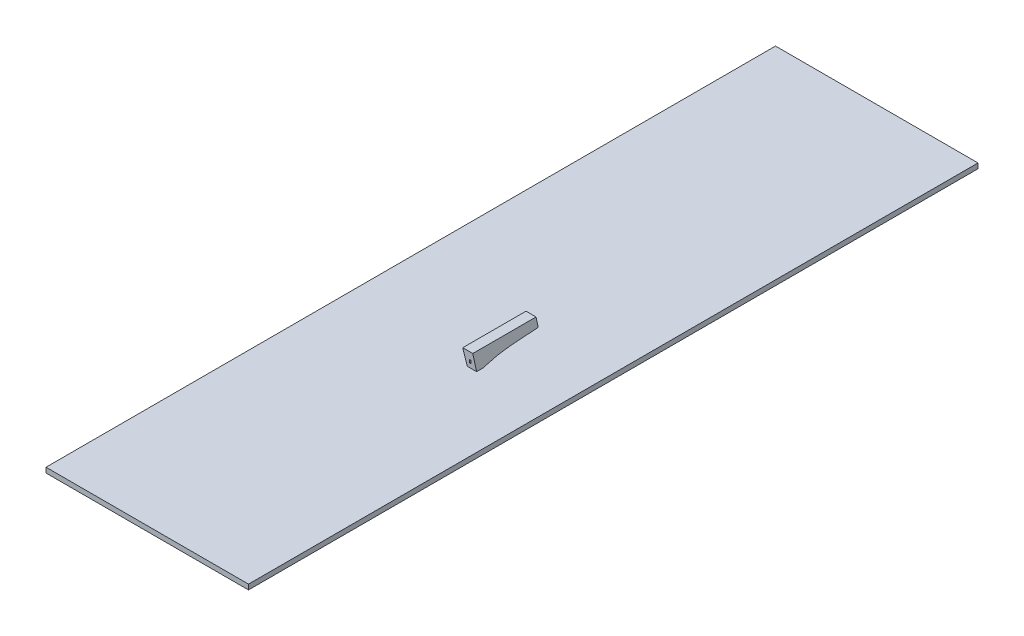
ISO-10303-21;
HEADER;
FILE_DESCRIPTION(('STEP AP214'),'2;1');
FILE_NAME('part.step','',(''),(''),'','','');
FILE_SCHEMA(('AUTOMOTIVE_DESIGN { 1 0 10303 214 1 1 1 1 }'));
ENDSEC;
DATA;
#1=APPLICATION_CONTEXT('core data for automotive mechanical design processes');
#2=APPLICATION_PROTOCOL_DEFINITION('international standard','automotive_design',2000,#1);
#3=PRODUCT_CONTEXT('',#1,'mechanical');
#4=PRODUCT('Part','Part','',(#3));
#5=PRODUCT_RELATED_PRODUCT_CATEGORY('part','',(#4));
#6=PRODUCT_DEFINITION_FORMATION('','',#4);
#7=PRODUCT_DEFINITION_CONTEXT('part definition',#1,'design');
#8=PRODUCT_DEFINITION('design','',#6,#7);
#9=PRODUCT_DEFINITION_SHAPE('','',#8);
#10=(LENGTH_UNIT() NAMED_UNIT(*) SI_UNIT(.MILLI.,.METRE.));
#11=(NAMED_UNIT(*) PLANE_ANGLE_UNIT() SI_UNIT($,.RADIAN.));
#12=(NAMED_UNIT(*) SI_UNIT($,.STERADIAN.) SOLID_ANGLE_UNIT());
#13=UNCERTAINTY_MEASURE_WITH_UNIT(LENGTH_MEASURE(1.E-05),#10,'distance_accuracy_value','');
#14=(GEOMETRIC_REPRESENTATION_CONTEXT(3) GLOBAL_UNCERTAINTY_ASSIGNED_CONTEXT((#13)) GLOBAL_UNIT_ASSIGNED_CONTEXT((#10,
#11,#12)) REPRESENTATION_CONTEXT('',''));
#15=CARTESIAN_POINT('',(0.,0.,0.));
#16=DIRECTION('',(0.,0.,1.));
#17=DIRECTION('',(1.,0.,0.));
#18=AXIS2_PLACEMENT_3D('',#15,#16,#17);
#19=CARTESIAN_POINT('',(0.,0.,-0.906787209581206));
#20=DIRECTION('',(0.,0.,1.));
#21=DIRECTION('',(1.,0.,0.));
#22=AXIS2_PLACEMENT_3D('',#19,#20,#21);
#23=PLANE('',#22);
#24=DIRECTION('',(0.2647824909299,-0.964308162620724,0.));
#25=VECTOR('',#24,1.);
#26=CARTESIAN_POINT('',(38.8064860248671,394.0012038353,-0.906787209581206));
#27=LINE('',#26,#25);
#28=CARTESIAN_POINT('',(54.3516519773393,337.387451299709,-0.906787209581206));
#29=VERTEX_POINT('',#28);
#30=CARTESIAN_POINT('',(58.641560608186,321.764084758008,-0.906787209581232));
#31=VERTEX_POINT('',#30);
#32=EDGE_CURVE('E497',#29,#31,#27,.T.);
#33=ORIENTED_EDGE('',*,*,#32,.T.);
#34=DIRECTION('',(1.,0.,0.));
#35=VECTOR('',#34,1.);
#36=CARTESIAN_POINT('',(51.0840248538438,321.764084758008,-0.906787209581232));
#37=LINE('',#36,#35);
#38=CARTESIAN_POINT('',(39.8206611898017,321.764084758008,-0.906787209581232));
#39=VERTEX_POINT('',#38);
#40=EDGE_CURVE('E14',#31,#39,#37,.F.);
#41=ORIENTED_EDGE('',*,*,#40,.T.);
#42=CARTESIAN_POINT('',(79.5934517566759,140.935265317445,-0.906787209581206));
#43=CARTESIAN_POINT('',(67.7143056578116,242.605545870488,-0.906787209581206));
#44=CARTESIAN_POINT('',(33.8252863264388,339.461806899819,-0.906787209581206));
#45=B_SPLINE_CURVE_WITH_KNOTS('',2,(#42,#43,#44),.UNSPECIFIED.,.F.,.F.,(3,3),(0.,1.),.UNSPECIFIED.);
#46=CARTESIAN_POINT('',(34.5483666432307,337.387451299709,-0.906787209581206));
#47=VERTEX_POINT('',#46);
#48=EDGE_CURVE('E509',#39,#47,#45,.T.);
#49=ORIENTED_EDGE('',*,*,#48,.T.);
#50=DIRECTION('',(-1.,0.,0.));
#51=VECTOR('',#50,1.);
#52=CARTESIAN_POINT('',(0.,337.387451299709,-0.906787209581206));
#53=LINE('',#52,#51);
#54=EDGE_CURVE('E514',#29,#47,#53,.T.);
#55=ORIENTED_EDGE('',*,*,#54,.F.);
#56=EDGE_LOOP('',(#33,#41,#49,#55));
#57=FACE_BOUND('',#56,.T.);
#58=DIRECTION('',(0.,1.,0.));
#59=VECTOR('',#58,1.);
#60=CARTESIAN_POINT('',(45.9013625124118,326.877081955028,-0.906787209581206));
#61=LINE('',#60,#59);
#62=CARTESIAN_POINT('',(45.9013625124118,326.877081955028,-0.906787209581206));
#63=VERTEX_POINT('',#62);
#64=CARTESIAN_POINT('',(45.9013625124118,331.877081955028,-0.906787209581206));
#65=VERTEX_POINT('',#64);
#66=EDGE_CURVE('E454',#63,#65,#61,.T.);
#67=ORIENTED_EDGE('',*,*,#66,.F.);
#68=DIRECTION('',(-1.,0.,0.));
#69=VECTOR('',#68,1.);
#70=CARTESIAN_POINT('',(47.9013625124118,326.877081955028,-0.906787209581206));
#71=LINE('',#70,#69);
#72=CARTESIAN_POINT('',(47.9013625124118,326.877081955028,-0.906787209581206));
#73=VERTEX_POINT('',#72);
#74=EDGE_CURVE('E451',#73,#63,#71,.T.);
#75=ORIENTED_EDGE('',*,*,#74,.F.);
#76=DIRECTION('',(0.,-1.,0.));
#77=VECTOR('',#76,1.);
#78=CARTESIAN_POINT('',(47.9013625124118,326.877081955028,-0.906787209581206));
#79=LINE('',#78,#77);
#80=CARTESIAN_POINT('',(47.9013625124118,331.877081955028,-0.906787209581206));
#81=VERTEX_POINT('',#80);
#82=EDGE_CURVE('E364',#81,#73,#79,.T.);
#83=ORIENTED_EDGE('',*,*,#82,.F.);
#84=DIRECTION('',(1.,0.,0.));
#85=VECTOR('',#84,1.);
#86=CARTESIAN_POINT('',(47.9013625124118,331.877081955028,-0.906787209581206));
#87=LINE('',#86,#85);
#88=EDGE_CURVE('E359',#65,#81,#87,.T.);
#89=ORIENTED_EDGE('',*,*,#88,.F.);
#90=EDGE_LOOP('',(#67,#75,#83,#89));
#91=FACE_BOUND('',#90,.T.);
#92=ADVANCED_FACE('F341',(#57,#91),#23,.F.);
#93=CARTESIAN_POINT('',(79.5934517566759,140.935265317445,459.688927372495));
#94=CARTESIAN_POINT('',(67.7143056578116,242.605545870488,459.688927372495));
#95=CARTESIAN_POINT('',(33.8252863264388,339.461806899819,459.688927372495));
#96=B_SPLINE_CURVE_WITH_KNOTS('',2,(#93,#94,#95),.UNSPECIFIED.,.F.,.F.,(3,3),(0.,1.),.UNSPECIFIED.);
#97=DIRECTION('',(0.,0.,-1.));
#98=VECTOR('',#97,1.);
#99=SURFACE_OF_LINEAR_EXTRUSION('',#96,#98);
#100=ORIENTED_EDGE('',*,*,#48,.F.);
#101=CARTESIAN_POINT('',(79.5934517566759,140.935265317445,391.136402899549));
#102=CARTESIAN_POINT('',(79.3687636637498,142.858316453914,389.058424904759));
#103=CARTESIAN_POINT('',(79.1392182173972,144.771086035841,386.971456801504));
#104=CARTESIAN_POINT('',(78.6706941483576,148.576580548362,382.778754123729));
#105=CARTESIAN_POINT('',(78.4317115785407,150.46929666258,380.673011988149));
#106=CARTESIAN_POINT('',(77.9447031754796,154.234211981581,376.443017842211));
#107=CARTESIAN_POINT('',(77.6966743145013,156.106404039311,374.318759819137));
#108=CARTESIAN_POINT('',(77.1919729110904,159.82981437306,370.052003197144));
#109=CARTESIAN_POINT('',(76.9352981935649,161.681027212279,367.909500111035));
#110=CARTESIAN_POINT('',(76.4137119289455,165.362035729348,363.606533479653));
#111=CARTESIAN_POINT('',(76.1487989922105,167.191827721442,361.446066949791));
#112=CARTESIAN_POINT('',(75.611150182316,170.829565172322,357.107465303158));
#113=CARTESIAN_POINT('',(75.3384136380759,172.637508738012,354.929328682273));
#114=CARTESIAN_POINT('',(74.7825838359121,176.250333696679,350.532323341911));
#115=CARTESIAN_POINT('',(74.499411042229,178.054975844669,348.313268092065));
#116=CARTESIAN_POINT('',(73.9259406297601,181.641120417636,343.857727305795));
#117=CARTESIAN_POINT('',(73.635643544893,183.422624561445,341.62124308408));
#118=CARTESIAN_POINT('',(73.0483658059418,186.96211123388,337.131159839954));
#119=CARTESIAN_POINT('',(72.7513861636136,188.720097259792,334.877563442147));
#120=CARTESIAN_POINT('',(72.1511885718739,192.212179894735,330.353583779646));
#121=CARTESIAN_POINT('',(71.8479720472944,193.946281812281,328.083204423347));
#122=CARTESIAN_POINT('',(71.2357484385393,197.390246372087,323.525993628031));
#123=CARTESIAN_POINT('',(70.9267431282756,199.100116166777,321.239167357176));
#124=CARTESIAN_POINT('',(70.303394231065,202.495271118772,316.649425312154));
#125=CARTESIAN_POINT('',(69.989052702724,204.18056531048,314.34651593565));
#126=CARTESIAN_POINT('',(69.0335808605556,209.22611062359,307.376860789141));
#127=CARTESIAN_POINT('',(68.3847399206868,212.549439665433,302.68435652347));
#128=CARTESIAN_POINT('',(67.0701854973035,219.095768358947,293.233369364994));
#129=CARTESIAN_POINT('',(66.404474671083,222.31878363571,288.474896916127));
#130=CARTESIAN_POINT('',(65.0592484047373,228.664771029444,278.890806517958));
#131=CARTESIAN_POINT('',(64.3797274891773,231.787702148571,274.065162185009));
#132=CARTESIAN_POINT('',(63.0099032766274,237.933677624573,264.345567383805));
#133=CARTESIAN_POINT('',(62.3195901962393,240.956622557449,259.451555424208));
#134=CARTESIAN_POINT('',(60.9311537864223,246.902696215732,249.59402280875));
#135=CARTESIAN_POINT('',(60.2330201292298,249.825665260063,244.63040731805));
#136=CARTESIAN_POINT('',(58.8318541371306,255.571818036939,234.63232496169));
#137=CARTESIAN_POINT('',(58.1288146069011,258.3947800764,229.597731531008));
#138=CARTESIAN_POINT('',(57.1935213979447,262.078580898934,222.861633852702));
#139=CARTESIAN_POINT('',(56.9613207265983,262.987258538716,221.18615655955));
#140=CARTESIAN_POINT('',(56.497018148693,264.7928870135,217.828873855044));
#141=CARTESIAN_POINT('',(56.2649162420974,265.68983785287,216.147068446046));
#142=CARTESIAN_POINT('',(55.800928193183,267.471976095472,212.777211285217));
#143=CARTESIAN_POINT('',(55.5690420506503,268.357163510387,211.089159539592));
#144=CARTESIAN_POINT('',(55.1055150104447,270.116067691075,207.706271742908));
#145=CARTESIAN_POINT('',(54.8738742313432,270.989780205917,206.011433465154));
#146=CARTESIAN_POINT('',(54.4110369855361,272.725374072101,202.615647068307));
#147=CARTESIAN_POINT('',(54.179840519342,273.587255409829,200.914698942185));
#148=CARTESIAN_POINT('',(53.7179943512896,275.299197010219,197.506781668418));
#149=CARTESIAN_POINT('',(53.4873446517118,276.14925722365,195.799812495733));
#150=CARTESIAN_POINT('',(53.0269738339519,277.836536495195,192.381629132772));
#151=CARTESIAN_POINT('',(52.7972520043579,278.673767869785,190.67042112013));
#152=CARTESIAN_POINT('',(52.3389524274677,280.335025036273,187.241457973822));
#153=CARTESIAN_POINT('',(52.1103746759706,281.159050876684,185.523702864236));
#154=CARTESIAN_POINT('',(51.6548089568672,282.792719975596,182.08115155259));
#155=CARTESIAN_POINT('',(51.4278209902987,283.602363224708,180.356355345934));
#156=CARTESIAN_POINT('',(50.9764347080471,285.204166233441,176.903262793913));
#157=CARTESIAN_POINT('',(50.7520315978677,285.996362270641,175.174983914252));
#158=CARTESIAN_POINT('',(50.3057700035484,287.563957184985,171.710489726359));
#159=CARTESIAN_POINT('',(50.08391152346,288.339356035386,169.974274405498));
#160=CARTESIAN_POINT('',(49.6432519360557,289.872067534303,166.493483392676));
#161=CARTESIAN_POINT('',(49.4244508342734,290.629380150087,164.748907685592));
#162=CARTESIAN_POINT('',(48.9911261503781,292.122232551045,161.256522813757));
#163=CARTESIAN_POINT('',(48.7765912520355,292.857833483018,159.508741209265));
#164=CARTESIAN_POINT('',(48.3516444346216,294.30838915643,156.004124540337));
#165=CARTESIAN_POINT('',(48.1412325188313,295.023343881441,154.247289468698));
#166=CARTESIAN_POINT('',(47.7251065291384,296.431212900646,150.724240653962));
#167=CARTESIAN_POINT('',(47.5193924759146,297.124127097828,148.958026869625));
#168=CARTESIAN_POINT('',(47.1139326989118,298.484219907492,145.421805991695));
#169=CARTESIAN_POINT('',(46.9141694950678,299.151476015422,143.651830733281));
#170=CARTESIAN_POINT('',(46.5205199756487,300.461188371476,140.102073425613));
#171=CARTESIAN_POINT('',(46.3266336532539,301.103644648379,138.322291387742));
#172=CARTESIAN_POINT('',(45.9453739079274,302.362242621571,134.752752367418));
#173=CARTESIAN_POINT('',(45.7580004518728,302.978384451692,132.962995435748));
#174=CARTESIAN_POINT('',(45.412362874862,304.110906172488,129.587659618129));
#175=CARTESIAN_POINT('',(45.2532940471008,304.630414655301,128.00321278615));
#176=CARTESIAN_POINT('',(44.9411751369235,305.646729573562,124.82646647527));
#177=CARTESIAN_POINT('',(44.7881250235742,306.143536125687,123.234167036774));
#178=CARTESIAN_POINT('',(44.4885125739872,307.113336654501,120.041728414348));
#179=CARTESIAN_POINT('',(44.3419502057827,307.58633074852,118.441589269089));
#180=CARTESIAN_POINT('',(44.0557904643589,308.507375963105,115.233533855774));
#181=CARTESIAN_POINT('',(43.9161930436221,308.955427253841,113.625617640857));
#182=CARTESIAN_POINT('',(43.644444429816,309.825447090637,110.402098735397));
#183=CARTESIAN_POINT('',(43.5122932892914,310.247415452644,108.786495990701));
#184=CARTESIAN_POINT('',(43.2559229860042,311.06411545842,105.547753800314));
#185=CARTESIAN_POINT('',(43.1317039786648,311.458846568511,103.924614207613));
#186=CARTESIAN_POINT('',(42.8915869900027,312.220221497844,100.669676049396));
#187=CARTESIAN_POINT('',(42.7756961754288,312.586841143781,99.0378712936177));
#188=CARTESIAN_POINT('',(42.5528411696622,313.290447151525,95.7672901602894));
#189=CARTESIAN_POINT('',(42.4458768988971,313.627433777486,94.128513845022));
#190=CARTESIAN_POINT('',(42.2413582918541,314.270607486355,90.8443839934129));
#191=CARTESIAN_POINT('',(42.1438036124382,314.576795692402,89.1990306991933));
#192=CARTESIAN_POINT('',(42.0047594536942,315.012505646415,86.7241653987626));
#193=CARTESIAN_POINT('',(41.959570013736,315.153988484577,85.8969502781906));
#194=CARTESIAN_POINT('',(41.8717291248578,315.428794554503,84.2410289713605));
#195=CARTESIAN_POINT('',(41.829077671705,315.562117799876,83.4123227875915));
#196=CARTESIAN_POINT('',(41.7463853686939,315.820416118048,81.7534676097719));
#197=CARTESIAN_POINT('',(41.7063445592124,315.945391061731,80.9233185936097));
#198=CARTESIAN_POINT('',(41.6288600410489,316.187071243191,79.2616969834744));
#199=CARTESIAN_POINT('',(41.5914163350786,316.303776472334,78.4302243881202));
#200=CARTESIAN_POINT('',(41.518969595952,316.529437433033,76.7661252873505));
#201=CARTESIAN_POINT('',(41.4839665578271,316.638393180366,75.9334987842877));
#202=CARTESIAN_POINT('',(41.4162677295902,316.848998741198,74.267231422881));
#203=CARTESIAN_POINT('',(41.3835719402733,316.95064855218,73.4335905641876));
#204=CARTESIAN_POINT('',(41.2884731287368,317.24614563523,70.924497476887));
#205=CARTESIAN_POINT('',(41.2293531562595,317.429623670987,69.2476923090992));
#206=CARTESIAN_POINT('',(41.1186864414602,317.772762232303,65.8914184196841));
#207=CARTESIAN_POINT('',(41.067139744911,317.932422613908,64.21194968202));
#208=CARTESIAN_POINT('',(40.970439680571,318.231701474804,60.8510535896531));
#209=CARTESIAN_POINT('',(40.9252863265314,318.371319910988,59.1696262307453));
#210=CARTESIAN_POINT('',(40.8400619961568,318.63465615311,55.8005760519653));
#211=CARTESIAN_POINT('',(40.8000059094358,318.758327389135,54.1129492566728));
#212=CARTESIAN_POINT('',(40.7239214791555,318.99308596241,50.7367655370398));
#213=CARTESIAN_POINT('',(40.6878930739243,319.104173492343,49.0482086273391));
#214=CARTESIAN_POINT('',(40.6359630456762,319.264197698118,46.5149135969881));
#215=CARTESIAN_POINT('',(40.6190050756038,319.316438094726,45.6704022676302));
#216=CARTESIAN_POINT('',(40.5856408996054,319.419189335268,43.9812632290033));
#217=CARTESIAN_POINT('',(40.5692346937492,319.469700178983,43.1366355197197));
#218=CARTESIAN_POINT('',(40.536447367354,319.570616212936,41.4276233964024));
#219=CARTESIAN_POINT('',(40.5200757322497,319.620991537739,40.5632370466643));
#220=CARTESIAN_POINT('',(40.4875799199071,319.720952362135,38.8344141612651));
#221=CARTESIAN_POINT('',(40.4714557426548,319.770537861775,37.9699776256068));
#222=CARTESIAN_POINT('',(40.439434912289,319.868981566441,36.2410633360226));
#223=CARTESIAN_POINT('',(40.4235382580167,319.917839775172,35.3765855823293));
#224=CARTESIAN_POINT('',(40.3919734255628,320.014827200075,33.6475851008558));
#225=CARTESIAN_POINT('',(40.3763052473648,320.062956416298,32.7830623730788));
#226=CARTESIAN_POINT('',(40.3296368680389,320.206272523646,30.1894312432049));
#227=CARTESIAN_POINT('',(40.2989727772147,320.30038801168,28.4602574658485));
#228=CARTESIAN_POINT('',(40.2385260916251,320.485816445595,25.0023921333561));
#229=CARTESIAN_POINT('',(40.2087431719832,320.577130424827,23.2737006392541));
#230=CARTESIAN_POINT('',(40.1500193978231,320.757085335096,19.8161631632826));
#231=CARTESIAN_POINT('',(40.1210785438326,320.845726264459,18.087317181317));
#232=CARTESIAN_POINT('',(40.0640114132314,321.02042723996,14.6294811641508));
#233=CARTESIAN_POINT('',(40.0358851367489,321.106487285693,12.9004911289275));
#234=CARTESIAN_POINT('',(39.9804851244808,321.27591789444,9.44648148040414));
#235=CARTESIAN_POINT('',(39.9532095231717,321.359294357605,7.7214621863334));
#236=CARTESIAN_POINT('',(39.8994133376696,321.523663333882,4.27129834118603));
#237=CARTESIAN_POINT('',(39.8728927534583,321.604655847052,2.5461537901124));
#238=CARTESIAN_POINT('',(39.8205783754032,321.764349598502,-0.904252327572544));
#239=CARTESIAN_POINT('',(39.7947845815566,321.843050836791,-2.62951389418343));
#240=CARTESIAN_POINT('',(39.7440069895873,321.997914335382,-6.07257259590344));
#241=CARTESIAN_POINT('',(39.7190201328799,322.074086224439,-7.79036925303446));
#242=CARTESIAN_POINT('',(39.6697102727143,322.224342880412,-11.2260632369104));
#243=CARTESIAN_POINT('',(39.6453872692134,322.298427647463,-12.9439605636488));
#244=CARTESIAN_POINT('',(39.5973764748641,322.44460230926,-16.3798487659021));
#245=CARTESIAN_POINT('',(39.5736886839783,322.516692204125,-18.0978396414114));
#246=CARTESIAN_POINT('',(39.4806022731079,322.79987314704,-24.9368108408412));
#247=CARTESIAN_POINT('',(39.4135952610566,323.003463425198,-30.0581349643992));
#248=CARTESIAN_POINT('',(39.2847468674091,323.394525627863,-40.2577563729538));
#249=CARTESIAN_POINT('',(39.222866335664,323.582120111609,-45.3360484541877));
#250=CARTESIAN_POINT('',(39.162875884002,323.763812935846,-50.4145633031885));
#251=B_SPLINE_CURVE_WITH_KNOTS('',3,(#101,#102,#103,#104,#105,#106,#107,#108,#109,#110,#111,
#112,#113,#114,#115,#116,#117,#118,#119,#120,#121,#122,#123,#124,#125,#126,#127,#128,#129,#130,
#131,#132,#133,#134,#135,#136,#137,#138,#139,#140,#141,#142,#143,#144,#145,#146,#147,#148,#149,
#150,#151,#152,#153,#154,#155,#156,#157,#158,#159,#160,#161,#162,#163,#164,#165,#166,#167,#168,
#169,#170,#171,#172,#173,#174,#175,#176,#177,#178,#179,#180,#181,#182,#183,#184,#185,#186,#187,
#188,#189,#190,#191,#192,#193,#194,#195,#196,#197,#198,#199,#200,#201,#202,#203,#204,#205,#206,
#207,#208,#209,#210,#211,#212,#213,#214,#215,#216,#217,#218,#219,#220,#221,#222,#223,#224,#225,
#226,#227,#228,#229,#230,#231,#232,#233,#234,#235,#236,#237,#238,#239,#240,#241,#242,#243,#244,
#245,#246,#247,#248,#249,#250),.UNSPECIFIED.,.F.,.F.,(4,2,2,2,2,2,2,2,2,2,2,2,2,2,2,2,2,2,2,2,2,
2,2,2,2,2,2,2,2,2,2,2,2,2,2,2,2,2,2,2,2,2,2,2,2,2,2,2,2,2,2,2,2,2,2,2,2,2,2,2,2,2,2,2,2,2,2,2,2,
2,2,2,2,2,4),(0.,8.52049310582925,17.0445885068398,25.571563529311,34.1006999982727,
42.6312830692685,51.1626000635804,59.7850975333847,68.4069507652903,77.0275072952003,
85.6461158414953,94.2621251628804,102.87488291321,120.233391736256,137.589183089328,
154.951995373444,172.331583282363,189.737743773242,207.180341250756,212.940653116987,
218.700962837602,224.461266836584,230.223647768719,235.986035330797,241.74844688381,
247.504927353859,253.26138667179,259.017849747183,264.760926907832,270.504013211035,
276.247109907106,281.972089895268,287.697074438878,293.422084177621,299.128170578043,
304.834250356832,310.540301111698,315.56516462438,320.590002308422,325.614815231164,
330.639593868169,335.664407958111,340.689320474734,345.718506598372,350.747647886409,
355.776605708204,358.297897796688,360.819185680174,363.340512549271,365.861842050932,
368.383166419455,370.904491656798,375.967794947679,381.031128839784,386.094473622234,
391.172285043374,396.250018702513,398.788903815364,401.327789249377,403.925812003328,
406.523834609713,409.121843977882,411.719853159037,416.915864222169,422.109935086548,
427.304009205013,432.498084140841,437.679827561599,442.861570857705,448.043314134694,
453.202311299509,458.361308132942,463.520304662313,478.897699630201,494.144067563522),.UNSPECIFIED.);
#252=CARTESIAN_POINT('',(44.8715710734919,305.872294377729,124.093212790419));
#253=VERTEX_POINT('',#252);
#254=EDGE_CURVE('E543',#253,#39,#251,.T.);
#255=ORIENTED_EDGE('',*,*,#254,.F.);
#256=CARTESIAN_POINT('',(79.5934517566759,140.935265317445,124.093212790419));
#257=CARTESIAN_POINT('',(67.7143056578116,242.605545870488,124.093212790419));
#258=CARTESIAN_POINT('',(33.8252863264388,339.461806899819,124.093212790419));
#259=B_SPLINE_CURVE_WITH_KNOTS('',2,(#256,#257,#258),.UNSPECIFIED.,.F.,.F.,(3,3),(0.,1.),.UNSPECIFIED.);
#260=CARTESIAN_POINT('',(34.5483666432307,337.387451299709,124.093212790419));
#261=VERTEX_POINT('',#260);
#262=EDGE_CURVE('E524',#261,#253,#259,.F.);
#263=ORIENTED_EDGE('',*,*,#262,.F.);
#264=DIRECTION('',(0.,0.,-1.));
#265=VECTOR('',#264,1.);
#266=CARTESIAN_POINT('',(34.5483666432307,337.387451299709,-75.3342967017252));
#267=LINE('',#266,#265);
#268=EDGE_CURVE('E540',#47,#261,#267,.F.);
#269=ORIENTED_EDGE('',*,*,#268,.F.);
#270=EDGE_LOOP('',(#100,#255,#263,#269));
#271=FACE_BOUND('',#270,.T.);
#272=ADVANCED_FACE('F555',(#271),#99,.T.);
#273=CARTESIAN_POINT('',(38.8064860248671,394.0012038353,482.120102696812));
#274=DIRECTION('',(0.964308162620724,0.2647824909299,0.));
#275=DIRECTION('',(-0.2647824909299,0.964308162620724,0.));
#276=AXIS2_PLACEMENT_3D('',#273,#274,#275);
#277=PLANE('',#276);
#278=ORIENTED_EDGE('',*,*,#32,.F.);
#279=DIRECTION('',(0.,0.,-1.));
#280=VECTOR('',#279,1.);
#281=CARTESIAN_POINT('',(54.3516519773393,337.387451299709,482.120102696812));
#282=LINE('',#281,#280);
#283=CARTESIAN_POINT('',(54.3516519773393,337.387451299709,124.093212790419));
#284=VERTEX_POINT('',#283);
#285=EDGE_CURVE('E536',#284,#29,#282,.T.);
#286=ORIENTED_EDGE('',*,*,#285,.F.);
#287=DIRECTION('',(-0.2647824909299,0.964308162620724,0.));
#288=VECTOR('',#287,1.);
#289=CARTESIAN_POINT('',(38.8064860248671,394.0012038353,124.093212790419));
#290=LINE('',#289,#288);
#291=CARTESIAN_POINT('',(63.0051738236856,305.872294377729,124.093212790419));
#292=VERTEX_POINT('',#291);
#293=EDGE_CURVE('E521',#292,#284,#290,.T.);
#294=ORIENTED_EDGE('',*,*,#293,.F.);
#295=CARTESIAN_POINT('',(58.0924695306286,323.763812935846,-50.4145633031885));
#296=CARTESIAN_POINT('',(58.1103275309392,323.698776099735,-48.596729738279));
#297=CARTESIAN_POINT('',(58.1283930428494,323.632983529631,-46.7789251340995));
#298=CARTESIAN_POINT('',(58.1649694034,323.499776522952,-43.1433783443442));
#299=CARTESIAN_POINT('',(58.1834802524085,323.432362085036,-41.3256361588211));
#300=CARTESIAN_POINT('',(58.2209775764716,323.29580103244,-37.6902212039755));
#301=CARTESIAN_POINT('',(58.2399640516583,323.226654417278,-35.8725484346726));
#302=CARTESIAN_POINT('',(58.2786031719773,323.085935070658,-32.2221346028775));
#303=CARTESIAN_POINT('',(58.2982600495728,323.014346925043,-30.3893941790576));
#304=CARTESIAN_POINT('',(58.3381190902829,322.869184765053,-26.7239983017079));
#305=CARTESIAN_POINT('',(58.3583212532674,322.795610751151,-24.8913428481578));
#306=CARTESIAN_POINT('',(58.3993017664988,322.646364313901,-21.2261241093133));
#307=CARTESIAN_POINT('',(58.4200801166438,322.570691890924,-19.3935608240026));
#308=CARTESIAN_POINT('',(58.4623728293333,322.416666570282,-15.7173219975736));
#309=CARTESIAN_POINT('',(58.4838909171994,322.338300105413,-13.8736470674289));
#310=CARTESIAN_POINT('',(58.5275729097689,322.17921518312,-10.1864059530417));
#311=CARTESIAN_POINT('',(58.5497368145874,322.098496725276,-8.34283976881855));
#312=CARTESIAN_POINT('',(58.594741702751,321.934593965461,-4.65582439171699));
#313=CARTESIAN_POINT('',(58.6175826864025,321.851409662375,-2.81237519889186));
#314=CARTESIAN_POINT('',(58.6640646588103,321.682127527253,0.881689150167304));
#315=CARTESIAN_POINT('',(58.687708455122,321.596019470415,2.73230380275307));
#316=CARTESIAN_POINT('',(58.7357413392612,321.421089088549,6.43339466275907));
#317=CARTESIAN_POINT('',(58.7601304268699,321.332266764319,8.28387087021979));
#318=CARTESIAN_POINT('',(58.809685216654,321.151793772627,11.9846730173851));
#319=CARTESIAN_POINT('',(58.8348509179913,321.060143108218,13.8349989572497));
#320=CARTESIAN_POINT('',(58.8860370248498,320.873729042533,17.5388805026588));
#321=CARTESIAN_POINT('',(58.9120589113898,320.778960247552,19.3924358164134));
#322=CARTESIAN_POINT('',(58.964944822574,320.586355684979,23.0993762141358));
#323=CARTESIAN_POINT('',(58.9918088477191,320.488519915563,24.9527612980018));
#324=CARTESIAN_POINT('',(59.0464102319822,320.289667792258,28.6593522111146));
#325=CARTESIAN_POINT('',(59.0741475929995,320.188651431453,30.5125580399628));
#326=CARTESIAN_POINT('',(59.1164282170848,320.034670136153,33.2919781636149));
#327=CARTESIAN_POINT('',(59.1306322958778,319.982940472781,34.2182662078862));
#328=CARTESIAN_POINT('',(59.1592702272593,319.87864433562,36.0707918009839));
#329=CARTESIAN_POINT('',(59.1737040798776,319.826077861723,36.9970293498038));
#330=CARTESIAN_POINT('',(59.1955302518753,319.746589388969,38.3863465550612));
#331=CARTESIAN_POINT('',(59.2028348765556,319.719986764379,38.8494458855016));
#332=CARTESIAN_POINT('',(59.2175027754403,319.666567920205,39.775631294913));
#333=CARTESIAN_POINT('',(59.2248660496443,319.639751700622,40.2387173738842));
#334=CARTESIAN_POINT('',(59.2470753086739,319.558868067823,41.6279484696579));
#335=CARTESIAN_POINT('',(59.2620407299888,319.504365680296,42.5540663499135));
#336=CARTESIAN_POINT('',(59.2924607550998,319.393579357459,44.4061952047087));
#337=CARTESIAN_POINT('',(59.3079153626103,319.337295408622,45.3322061783828));
#338=CARTESIAN_POINT('',(59.3394839834182,319.22232602896,47.1840674457561));
#339=CARTESIAN_POINT('',(59.3555979966217,319.163640598476,48.1099177394781));
#340=CARTESIAN_POINT('',(59.4044770952174,318.98562839838,50.8475086254013));
#341=CARTESIAN_POINT('',(59.4384168221305,318.862023715969,52.6589553197908));
#342=CARTESIAN_POINT('',(59.510756897821,318.598569266137,56.2805779017311));
#343=CARTESIAN_POINT('',(59.5491572126038,318.458719622521,58.0907537988611));
#344=CARTESIAN_POINT('',(59.6317070252416,318.158082454747,61.7093072396926));
#345=CARTESIAN_POINT('',(59.6758566844122,317.997294343095,63.5176847314992));
#346=CARTESIAN_POINT('',(59.7710001597116,317.650792467049,67.124412660302));
#347=CARTESIAN_POINT('',(59.821965216286,317.46518344173,68.9227738384135));
#348=CARTESIAN_POINT('',(59.9321552876181,317.06388354893,72.5159054189664));
#349=CARTESIAN_POINT('',(59.9913801987027,316.848193059016,74.3106758661897));
#350=CARTESIAN_POINT('',(60.0873594552178,316.498647361433,76.9991400429011));
#351=CARTESIAN_POINT('',(60.1205421829232,316.377799585314,77.8946631604459));
#352=CARTESIAN_POINT('',(60.1894519366142,316.126837983831,79.6843146688381));
#353=CARTESIAN_POINT('',(60.2251789567387,315.996724179813,80.5784430628937));
#354=CARTESIAN_POINT('',(60.2991497155366,315.727330964825,82.3612689894322));
#355=CARTESIAN_POINT('',(60.33738195145,315.588093445618,83.2499733259229));
#356=CARTESIAN_POINT('',(60.4164380116852,315.300180132613,85.0257338174542));
#357=CARTESIAN_POINT('',(60.4572618420167,315.151504316928,85.9127899686679));
#358=CARTESIAN_POINT('',(60.5835596120438,314.691541990377,88.571464819865));
#359=CARTESIAN_POINT('',(60.6728566611969,314.366332143254,90.340513710488));
#360=CARTESIAN_POINT('',(60.8612523355976,313.680216207155,93.8711511699027));
#361=CARTESIAN_POINT('',(60.960351099798,313.319309612129,95.6327396325633));
#362=CARTESIAN_POINT('',(61.1677526091826,312.563976554656,99.1445383962014));
#363=CARTESIAN_POINT('',(61.2760369267274,312.169617203607,100.894764234385));
#364=CARTESIAN_POINT('',(61.5015795505212,311.348216240199,104.386910201218));
#365=CARTESIAN_POINT('',(61.6188376757629,310.921175287049,106.128830496642));
#366=CARTESIAN_POINT('',(61.8619308670524,310.035857123394,109.604060140812));
#367=CARTESIAN_POINT('',(61.987765878717,309.577580110947,111.337369544083));
#368=CARTESIAN_POINT('',(62.5073368189492,307.685360965464,118.251090939567));
#369=CARTESIAN_POINT('',(62.9338305505371,306.132118584396,123.396853793968));
#370=CARTESIAN_POINT('',(63.850135222645,302.795039642137,133.607368648497));
#371=CARTESIAN_POINT('',(64.339958889208,301.011156734122,138.672104135821));
#372=CARTESIAN_POINT('',(65.3843292218594,297.207677006147,148.831056013257));
#373=CARTESIAN_POINT('',(65.9400428466358,295.183830253405,153.923557141167));
#374=CARTESIAN_POINT('',(66.7123963440279,292.371005359477,160.667053262973));
#375=CARTESIAN_POINT('',(66.9084720538192,291.656919595046,162.352138522303));
#376=CARTESIAN_POINT('',(67.3054768657702,290.211072555012,165.714156201095));
#377=CARTESIAN_POINT('',(67.5064059548867,289.479311326909,167.391088642452));
#378=CARTESIAN_POINT('',(67.9127861366554,287.999320240525,170.737102130768));
#379=CARTESIAN_POINT('',(68.1182372192594,287.251090418838,172.406183195164));
#380=CARTESIAN_POINT('',(68.533861204292,285.737434436751,175.741008672689));
#381=CARTESIAN_POINT('',(68.7440445786847,284.971970138631,177.406734465441));
#382=CARTESIAN_POINT('',(69.1683260732099,283.426784477061,180.731053760155));
#383=CARTESIAN_POINT('',(69.3824241913056,282.647063121029,182.389647265827));
#384=CARTESIAN_POINT('',(69.8142303384837,281.074473517649,185.700120703644));
#385=CARTESIAN_POINT('',(70.0319383778653,280.281605232791,187.35200061662));
#386=CARTESIAN_POINT('',(70.471056813451,278.682385094385,190.652346936369));
#387=CARTESIAN_POINT('',(70.6924730259353,277.876012058595,192.300802298467));
#388=CARTESIAN_POINT('',(71.1383201794037,276.252286683624,195.591881009366));
#389=CARTESIAN_POINT('',(71.3627511135501,275.434934369346,197.234504371383));
#390=CARTESIAN_POINT('',(71.8145796951821,273.789425303233,200.513920719568));
#391=CARTESIAN_POINT('',(72.0419773418419,272.961268554406,202.150713707357));
#392=CARTESIAN_POINT('',(72.4999130685127,271.293517950378,205.419605755907));
#393=CARTESIAN_POINT('',(72.730453392923,270.453915921327,207.051700332066));
#394=CARTESIAN_POINT('',(73.1944927764068,268.763936483111,210.309876435113));
#395=CARTESIAN_POINT('',(73.4279918318746,267.91355908708,211.935957969326));
#396=CARTESIAN_POINT('',(73.897938930318,266.202064412952,215.182030769378));
#397=CARTESIAN_POINT('',(74.1343869722025,265.340947138829,216.802022037471));
#398=CARTESIAN_POINT('',(74.6101578671048,263.608242850564,220.035412083052));
#399=CARTESIAN_POINT('',(74.8494799445537,262.736658660957,221.648812488319));
#400=CARTESIAN_POINT('',(75.3310487812649,260.982838918294,224.869377861677));
#401=CARTESIAN_POINT('',(75.5732955427738,260.100603357056,226.476542824978));
#402=CARTESIAN_POINT('',(76.0607009689852,258.325527409433,229.684560571918));
#403=CARTESIAN_POINT('',(76.3058596345733,257.432687019823,231.285413353637));
#404=CARTESIAN_POINT('',(76.9260596556092,255.173988037719,235.30340096982));
#405=CARTESIAN_POINT('',(77.3029790291753,253.801289913673,237.716407122199));
#406=CARTESIAN_POINT('',(78.0634228045759,251.031838892733,242.527509732558));
#407=CARTESIAN_POINT('',(78.4469472051613,249.635086000388,244.925606193358));
#408=CARTESIAN_POINT('',(79.6060537911647,245.413749694104,252.089128034833));
#409=CARTESIAN_POINT('',(80.3914384132092,242.553466904352,256.832006678827));
#410=CARTESIAN_POINT('',(81.9869404580501,236.742827235865,266.249748500933));
#411=CARTESIAN_POINT('',(82.7970261836483,233.792585794773,270.924688347707));
#412=CARTESIAN_POINT('',(84.4417525072176,227.802676818825,280.207225186668));
#413=CARTESIAN_POINT('',(85.2763732446059,224.763081613985,284.814872361476));
#414=CARTESIAN_POINT('',(86.9699853777434,218.59513599733,293.963407906433));
#415=CARTESIAN_POINT('',(87.8289681261411,215.466817078201,298.50431911688));
#416=CARTESIAN_POINT('',(89.5711368699703,209.122033726261,307.520010454554));
#417=CARTESIAN_POINT('',(90.4543247733438,205.90556234494,311.994785325624));
#418=CARTESIAN_POINT('',(91.9235135361462,200.55494149601,319.28489324262));
#419=CARTESIAN_POINT('',(92.5025829998574,198.446035394931,322.120195568424));
#420=CARTESIAN_POINT('',(93.6705036860285,194.192599123472,327.763682204889));
#421=CARTESIAN_POINT('',(94.2593585701167,192.048055617853,330.571855712947));
#422=CARTESIAN_POINT('',(95.4466624802807,187.724027816537,336.160563772447));
#423=CARTESIAN_POINT('',(96.0451144553963,185.544532780767,338.941089385791));
#424=CARTESIAN_POINT('',(97.2514201410801,181.15130264219,344.474022741156));
#425=CARTESIAN_POINT('',(97.859276084408,178.937559407923,347.22642353978));
#426=CARTESIAN_POINT('',(99.0841886302409,174.476565169615,352.702647770767));
#427=CARTESIAN_POINT('',(99.7012467429562,172.229308665557,355.426466384587));
#428=CARTESIAN_POINT('',(100.944355178448,167.702047035991,360.84509208247));
#429=CARTESIAN_POINT('',(101.570406282041,165.42203906684,363.539896611413));
#430=CARTESIAN_POINT('',(102.823220401077,160.859430425346,368.865800724099));
#431=CARTESIAN_POINT('',(103.449871965489,158.577235645172,371.49727428761));
#432=CARTESIAN_POINT('',(104.711503082529,153.982516484908,376.73113114418));
#433=CARTESIAN_POINT('',(105.346481837158,151.669995011041,379.333517181075));
#434=CARTESIAN_POINT('',(106.624536885108,147.015461734733,384.508814939339));
#435=CARTESIAN_POINT('',(107.267611565047,144.673455808051,387.081732344083));
#436=CARTESIAN_POINT('',(108.561621339367,139.960817206059,392.197733734538));
#437=CARTESIAN_POINT('',(109.212554007962,137.590193365192,394.740826472277));
#438=CARTESIAN_POINT('',(110.522036036514,132.821206546979,399.796841504275));
#439=CARTESIAN_POINT('',(111.180582161375,130.422855351495,402.309775750679));
#440=CARTESIAN_POINT('',(112.505040900824,125.599325030361,407.305165402044));
#441=CARTESIAN_POINT('',(113.170949474457,123.174160621422,409.787636088254));
#442=CARTESIAN_POINT('',(113.840628259898,120.735265523539,412.255506908933));
#443=B_SPLINE_CURVE_WITH_KNOTS('',3,(#295,#296,#297,#298,#299,#300,#301,#302,#303,#304,#305,
#306,#307,#308,#309,#310,#311,#312,#313,#314,#315,#316,#317,#318,#319,#320,#321,#322,#323,#324,
#325,#326,#327,#328,#329,#330,#331,#332,#333,#334,#335,#336,#337,#338,#339,#340,#341,#342,#343,
#344,#345,#346,#347,#348,#349,#350,#351,#352,#353,#354,#355,#356,#357,#358,#359,#360,#361,#362,
#363,#364,#365,#366,#367,#368,#369,#370,#371,#372,#373,#374,#375,#376,#377,#378,#379,#380,#381,
#382,#383,#384,#385,#386,#387,#388,#389,#390,#391,#392,#393,#394,#395,#396,#397,#398,#399,#400,
#401,#402,#403,#404,#405,#406,#407,#408,#409,#410,#411,#412,#413,#414,#415,#416,#417,#418,#419,
#420,#421,#422,#423,#424,#425,#426,#427,#428,#429,#430,#431,#432,#433,#434,#435,#436,#437,#438,
#439,#440,#441,#442),.UNSPECIFIED.,.F.,.F.,(4,2,2,2,2,2,2,2,2,2,2,2,2,2,2,2,2,2,2,2,2,2,2,2,2,2,
2,2,2,2,2,2,2,2,2,2,2,2,2,2,2,2,2,2,2,2,2,2,2,2,2,2,2,2,2,2,2,2,2,2,2,2,2,2,2,2,2,2,2,2,2,2,2,
4),(0.,5.45725280158805,10.9145101147555,16.371768944725,21.8744979438684,27.377225630128,
32.8799523427257,38.4163462212171,43.9527410861533,49.4891384557874,55.047439557622,
60.6057390272954,66.1640324989261,71.7325063040703,77.3009834206397,82.869472646797,
85.6529926281983,88.4365129687926,89.8282738304423,91.2200346863043,94.0035563842259,
96.7870992219372,99.5706416630458,105.018511093778,110.46633900841,115.914319811574,
121.339996890901,126.765605876261,129.478311057176,132.191009989204,134.892024838875,
137.593045952165,142.995319552995,148.397669749447,153.789427319051,159.181076162187,
164.572690821902,180.740751402487,196.912065991774,213.431743895441,218.95355261374,
224.475346494159,229.9971281058,235.532641713533,241.068152441272,246.60367896469,
252.14889997701,257.694108414187,263.239315308034,268.788714770108,274.338107469664,
279.887498116019,285.43542346551,290.983353076974,296.53128437569,304.935918849553,
313.340551733999,330.121275234111,346.881303293009,363.628119048126,380.369063096609,
397.111330546712,407.853306346788,418.599396505221,429.348854573027,440.100905265625,
450.854740381742,461.609514911157,472.226778528341,482.843032016666,493.457202338579,
504.068175815278,514.674795106183,525.27585640363),.UNSPECIFIED.);
#444=EDGE_CURVE('E568',#31,#292,#443,.T.);
#445=ORIENTED_EDGE('',*,*,#444,.F.);
#446=EDGE_LOOP('',(#278,#286,#294,#445));
#447=FACE_BOUND('',#446,.T.);
#448=ADVANCED_FACE('F559',(#447),#277,.T.);
#449=CARTESIAN_POINT('',(0.,337.387451299709,0.));
#450=DIRECTION('',(0.,-1.,0.));
#451=DIRECTION('',(0.,0.,-1.));
#452=AXIS2_PLACEMENT_3D('',#449,#450,#451);
#453=PLANE('',#452);
#454=ORIENTED_EDGE('',*,*,#285,.T.);
#455=ORIENTED_EDGE('',*,*,#54,.T.);
#456=ORIENTED_EDGE('',*,*,#268,.T.);
#457=DIRECTION('',(1.,0.,0.));
#458=VECTOR('',#457,1.);
#459=CARTESIAN_POINT('',(0.,337.387451299709,124.093212790419));
#460=LINE('',#459,#458);
#461=EDGE_CURVE('E529',#261,#284,#460,.T.);
#462=ORIENTED_EDGE('',*,*,#461,.T.);
#463=EDGE_LOOP('',(#454,#455,#456,#462));
#464=FACE_BOUND('',#463,.T.);
#465=ADVANCED_FACE('F564',(#464),#453,.F.);
#466=CARTESIAN_POINT('',(-321.200733720247,120.735265523539,412.255506908933));
#467=CARTESIAN_POINT('',(-321.200733720247,184.28998488035,347.945615604378));
#468=CARTESIAN_POINT('',(-321.200733720247,260.118965510706,243.198199319056));
#469=CARTESIAN_POINT('',(-321.200733720247,315.383822661597,107.441933730423));
#470=CARTESIAN_POINT('',(-321.200733720247,321.489904749579,13.0570049985076));
#471=CARTESIAN_POINT('',(-321.200733720247,324.056750228038,-55.482106564492));
#472=CARTESIAN_POINT('',(-321.200733720247,329.770066062198,-245.254817305456));
#473=CARTESIAN_POINT('',(-321.200733720247,330.105519590004,-395.293106061705));
#474=CARTESIAN_POINT('',(-321.200733720247,316.677995768092,-529.808763742509));
#475=B_SPLINE_CURVE_WITH_KNOTS('',3,(#466,#467,#468,#469,#470,#471,#472,#473,#474),
.UNSPECIFIED.,.F.,.F.,(4,1,1,1,1,1,4),(0.,0.268354736053871,0.388679730465141,0.430559092744216,
0.551186882643778,0.59467935564418,1.),.UNSPECIFIED.);
#476=DIRECTION('',(1.,0.,0.));
#477=VECTOR('',#476,1.);
#478=SURFACE_OF_LINEAR_EXTRUSION('',#475,#477);
#479=ORIENTED_EDGE('',*,*,#40,.F.);
#480=ORIENTED_EDGE('',*,*,#444,.T.);
#481=DIRECTION('',(1.,0.,0.));
#482=VECTOR('',#481,1.);
#483=CARTESIAN_POINT('',(65.020911726963,305.872294377729,124.093212790419));
#484=LINE('',#483,#482);
#485=EDGE_CURVE('E352',#253,#292,#484,.T.);
#486=ORIENTED_EDGE('',*,*,#485,.F.);
#487=ORIENTED_EDGE('',*,*,#254,.T.);
#488=EDGE_LOOP('',(#479,#480,#486,#487));
#489=FACE_BOUND('',#488,.T.);
#490=ADVANCED_FACE('F343',(#489),#478,.T.);
#491=CARTESIAN_POINT('',(0.,0.,124.093212790419));
#492=DIRECTION('',(0.,0.,-1.));
#493=DIRECTION('',(-1.,0.,0.));
#494=AXIS2_PLACEMENT_3D('',#491,#492,#493);
#495=PLANE('',#494);
#496=DIRECTION('',(-1.,0.,0.));
#497=VECTOR('',#496,1.);
#498=CARTESIAN_POINT('',(47.9029923320848,323.936348523743,124.093212790419));
#499=LINE('',#498,#497);
#500=CARTESIAN_POINT('',(50.9029923320848,323.936348523743,124.093212790419));
#501=VERTEX_POINT('',#500);
#502=CARTESIAN_POINT('',(47.9029923320848,323.936348523743,124.093212790419));
#503=VERTEX_POINT('',#502);
#504=EDGE_CURVE('E460',#501,#503,#499,.T.);
#505=ORIENTED_EDGE('',*,*,#504,.F.);
#506=DIRECTION('',(0.,1.,0.));
#507=VECTOR('',#506,1.);
#508=CARTESIAN_POINT('',(50.9029923320848,317.936348523743,124.093212790419));
#509=LINE('',#508,#507);
#510=CARTESIAN_POINT('',(50.9029923320848,317.936348523743,124.093212790419));
#511=VERTEX_POINT('',#510);
#512=EDGE_CURVE('E456',#511,#501,#509,.T.);
#513=ORIENTED_EDGE('',*,*,#512,.F.);
#514=DIRECTION('',(1.,0.,0.));
#515=VECTOR('',#514,1.);
#516=CARTESIAN_POINT('',(47.9029923320848,317.936348523743,124.093212790419));
#517=LINE('',#516,#515);
#518=CARTESIAN_POINT('',(47.9029923320848,317.936348523743,124.093212790419));
#519=VERTEX_POINT('',#518);
#520=EDGE_CURVE('E471',#519,#511,#517,.T.);
#521=ORIENTED_EDGE('',*,*,#520,.F.);
#522=DIRECTION('',(0.,-1.,0.));
#523=VECTOR('',#522,1.);
#524=CARTESIAN_POINT('',(47.9029923320848,317.936348523743,124.093212790419));
#525=LINE('',#524,#523);
#526=EDGE_CURVE('E487',#503,#519,#525,.T.);
#527=ORIENTED_EDGE('',*,*,#526,.F.);
#528=EDGE_LOOP('',(#505,#513,#521,#527));
#529=FACE_BOUND('',#528,.T.);
#530=ORIENTED_EDGE('',*,*,#262,.T.);
#531=ORIENTED_EDGE('',*,*,#485,.T.);
#532=ORIENTED_EDGE('',*,*,#293,.T.);
#533=ORIENTED_EDGE('',*,*,#461,.F.);
#534=EDGE_LOOP('',(#530,#531,#532,#533));
#535=FACE_BOUND('',#534,.T.);
#536=ADVANCED_FACE('F582',(#529,#535),#495,.F.);
#537=CARTESIAN_POINT('',(50.9029923320848,317.936348523743,119.093212790419));
#538=DIRECTION('',(1.,0.,0.));
#539=DIRECTION('',(0.,0.,-1.));
#540=AXIS2_PLACEMENT_3D('',#537,#538,#539);
#541=PLANE('',#540);
#542=ORIENTED_EDGE('',*,*,#512,.T.);
#543=DIRECTION('',(0.,0.,1.));
#544=VECTOR('',#543,1.);
#545=CARTESIAN_POINT('',(50.9029923320848,323.936348523743,119.093212790419));
#546=LINE('',#545,#544);
#547=CARTESIAN_POINT('',(50.9029923320848,323.936348523743,119.093212790419));
#548=VERTEX_POINT('',#547);
#549=EDGE_CURVE('E482',#548,#501,#546,.T.);
#550=ORIENTED_EDGE('',*,*,#549,.F.);
#551=DIRECTION('',(0.,1.,0.));
#552=VECTOR('',#551,1.);
#553=CARTESIAN_POINT('',(50.9029923320848,317.936348523743,119.093212790419));
#554=LINE('',#553,#552);
#555=CARTESIAN_POINT('',(50.9029923320848,317.936348523743,119.093212790419));
#556=VERTEX_POINT('',#555);
#557=EDGE_CURVE('E466',#556,#548,#554,.T.);
#558=ORIENTED_EDGE('',*,*,#557,.F.);
#559=DIRECTION('',(0.,0.,1.));
#560=VECTOR('',#559,1.);
#561=CARTESIAN_POINT('',(50.9029923320848,317.936348523743,119.093212790419));
#562=LINE('',#561,#560);
#563=EDGE_CURVE('E494',#556,#511,#562,.T.);
#564=ORIENTED_EDGE('',*,*,#563,.T.);
#565=EDGE_LOOP('',(#542,#550,#558,#564));
#566=FACE_BOUND('',#565,.T.);
#567=ADVANCED_FACE('F643',(#566),#541,.F.);
#568=CARTESIAN_POINT('',(47.9029923320848,317.936348523743,119.093212790419));
#569=DIRECTION('',(0.,-1.,0.));
#570=DIRECTION('',(0.,0.,-1.));
#571=AXIS2_PLACEMENT_3D('',#568,#569,#570);
#572=PLANE('',#571);
#573=ORIENTED_EDGE('',*,*,#520,.T.);
#574=ORIENTED_EDGE('',*,*,#563,.F.);
#575=DIRECTION('',(1.,0.,0.));
#576=VECTOR('',#575,1.);
#577=CARTESIAN_POINT('',(47.9029923320848,317.936348523743,119.093212790419));
#578=LINE('',#577,#576);
#579=CARTESIAN_POINT('',(47.9029923320848,317.936348523743,119.093212790419));
#580=VERTEX_POINT('',#579);
#581=EDGE_CURVE('E479',#580,#556,#578,.T.);
#582=ORIENTED_EDGE('',*,*,#581,.F.);
#583=DIRECTION('',(0.,0.,1.));
#584=VECTOR('',#583,1.);
#585=CARTESIAN_POINT('',(47.9029923320848,317.936348523743,119.093212790419));
#586=LINE('',#585,#584);
#587=EDGE_CURVE('E498',#580,#519,#586,.T.);
#588=ORIENTED_EDGE('',*,*,#587,.T.);
#589=EDGE_LOOP('',(#573,#574,#582,#588));
#590=FACE_BOUND('',#589,.T.);
#591=ADVANCED_FACE('F639',(#590),#572,.F.);
#592=CARTESIAN_POINT('',(47.9029923320848,317.936348523743,119.093212790419));
#593=DIRECTION('',(-1.,0.,0.));
#594=DIRECTION('',(0.,0.,1.));
#595=AXIS2_PLACEMENT_3D('',#592,#593,#594);
#596=PLANE('',#595);
#597=ORIENTED_EDGE('',*,*,#526,.T.);
#598=ORIENTED_EDGE('',*,*,#587,.F.);
#599=DIRECTION('',(0.,-1.,0.));
#600=VECTOR('',#599,1.);
#601=CARTESIAN_POINT('',(47.9029923320848,317.936348523743,119.093212790419));
#602=LINE('',#601,#600);
#603=CARTESIAN_POINT('',(47.9029923320848,323.936348523743,119.093212790419));
#604=VERTEX_POINT('',#603);
#605=EDGE_CURVE('E475',#604,#580,#602,.T.);
#606=ORIENTED_EDGE('',*,*,#605,.F.);
#607=DIRECTION('',(0.,0.,1.));
#608=VECTOR('',#607,1.);
#609=CARTESIAN_POINT('',(47.9029923320848,323.936348523743,119.093212790419));
#610=LINE('',#609,#608);
#611=EDGE_CURVE('E501',#604,#503,#610,.T.);
#612=ORIENTED_EDGE('',*,*,#611,.T.);
#613=EDGE_LOOP('',(#597,#598,#606,#612));
#614=FACE_BOUND('',#613,.T.);
#615=ADVANCED_FACE('F642',(#614),#596,.F.);
#616=CARTESIAN_POINT('',(47.9029923320848,323.936348523743,119.093212790419));
#617=DIRECTION('',(0.,1.,0.));
#618=DIRECTION('',(0.,0.,1.));
#619=AXIS2_PLACEMENT_3D('',#616,#617,#618);
#620=PLANE('',#619);
#621=ORIENTED_EDGE('',*,*,#504,.T.);
#622=ORIENTED_EDGE('',*,*,#611,.F.);
#623=DIRECTION('',(-1.,0.,0.));
#624=VECTOR('',#623,1.);
#625=CARTESIAN_POINT('',(47.9029923320848,323.936348523743,119.093212790419));
#626=LINE('',#625,#624);
#627=EDGE_CURVE('E470',#548,#604,#626,.T.);
#628=ORIENTED_EDGE('',*,*,#627,.F.);
#629=ORIENTED_EDGE('',*,*,#549,.T.);
#630=EDGE_LOOP('',(#621,#622,#628,#629));
#631=FACE_BOUND('',#630,.T.);
#632=ADVANCED_FACE('F637',(#631),#620,.F.);
#633=CARTESIAN_POINT('',(0.,0.,119.093212790419));
#634=DIRECTION('',(0.,0.,-1.));
#635=DIRECTION('',(-1.,0.,0.));
#636=AXIS2_PLACEMENT_3D('',#633,#634,#635);
#637=PLANE('',#636);
#638=ORIENTED_EDGE('',*,*,#557,.T.);
#639=ORIENTED_EDGE('',*,*,#627,.T.);
#640=ORIENTED_EDGE('',*,*,#605,.T.);
#641=ORIENTED_EDGE('',*,*,#581,.T.);
#642=EDGE_LOOP('',(#638,#639,#640,#641));
#643=FACE_BOUND('',#642,.T.);
#644=ADVANCED_FACE('F634',(#643),#637,.F.);
#645=CARTESIAN_POINT('',(45.9013625124118,326.877081955028,-5.90678720958121));
#646=DIRECTION('',(1.,0.,0.));
#647=DIRECTION('',(0.,0.,-1.));
#648=AXIS2_PLACEMENT_3D('',#645,#646,#647);
#649=PLANE('',#648);
#650=ORIENTED_EDGE('',*,*,#66,.T.);
#651=DIRECTION('',(0.,0.,1.));
#652=VECTOR('',#651,1.);
#653=CARTESIAN_POINT('',(45.9013625124118,331.877081955028,-5.90678720958121));
#654=LINE('',#653,#652);
#655=CARTESIAN_POINT('',(45.9013625124118,331.877081955028,-5.90678720958121));
#656=VERTEX_POINT('',#655);
#657=EDGE_CURVE('E433',#656,#65,#654,.T.);
#658=ORIENTED_EDGE('',*,*,#657,.F.);
#659=DIRECTION('',(0.,1.,0.));
#660=VECTOR('',#659,1.);
#661=CARTESIAN_POINT('',(45.9013625124118,326.877081955028,-5.90678720958121));
#662=LINE('',#661,#660);
#663=CARTESIAN_POINT('',(45.9013625124118,326.877081955028,-5.90678720958121));
#664=VERTEX_POINT('',#663);
#665=EDGE_CURVE('E441',#664,#656,#662,.T.);
#666=ORIENTED_EDGE('',*,*,#665,.F.);
#667=DIRECTION('',(0.,0.,1.));
#668=VECTOR('',#667,1.);
#669=CARTESIAN_POINT('',(45.9013625124118,326.877081955028,-5.90678720958121));
#670=LINE('',#669,#668);
#671=EDGE_CURVE('E605',#664,#63,#670,.T.);
#672=ORIENTED_EDGE('',*,*,#671,.T.);
#673=EDGE_LOOP('',(#650,#658,#666,#672));
#674=FACE_BOUND('',#673,.T.);
#675=ADVANCED_FACE('F453',(#674),#649,.F.);
#676=CARTESIAN_POINT('',(47.9013625124118,331.877081955028,-5.90678720958121));
#677=DIRECTION('',(0.,-1.,0.));
#678=DIRECTION('',(0.,0.,-1.));
#679=AXIS2_PLACEMENT_3D('',#676,#677,#678);
#680=PLANE('',#679);
#681=ORIENTED_EDGE('',*,*,#88,.T.);
#682=DIRECTION('',(0.,0.,1.));
#683=VECTOR('',#682,1.);
#684=CARTESIAN_POINT('',(47.9013625124118,331.877081955028,-5.90678720958121));
#685=LINE('',#684,#683);
#686=CARTESIAN_POINT('',(47.9013625124118,331.877081955028,-5.90678720958121));
#687=VERTEX_POINT('',#686);
#688=EDGE_CURVE('E436',#687,#81,#685,.T.);
#689=ORIENTED_EDGE('',*,*,#688,.F.);
#690=DIRECTION('',(1.,0.,0.));
#691=VECTOR('',#690,1.);
#692=CARTESIAN_POINT('',(47.9013625124118,331.877081955028,-5.90678720958121));
#693=LINE('',#692,#691);
#694=EDGE_CURVE('E429',#656,#687,#693,.T.);
#695=ORIENTED_EDGE('',*,*,#694,.F.);
#696=ORIENTED_EDGE('',*,*,#657,.T.);
#697=EDGE_LOOP('',(#681,#689,#695,#696));
#698=FACE_BOUND('',#697,.T.);
#699=ADVANCED_FACE('F431',(#698),#680,.F.);
#700=CARTESIAN_POINT('',(47.9013625124118,326.877081955028,-5.90678720958121));
#701=DIRECTION('',(-1.,0.,0.));
#702=DIRECTION('',(0.,0.,1.));
#703=AXIS2_PLACEMENT_3D('',#700,#701,#702);
#704=PLANE('',#703);
#705=ORIENTED_EDGE('',*,*,#82,.T.);
#706=DIRECTION('',(0.,0.,1.));
#707=VECTOR('',#706,1.);
#708=CARTESIAN_POINT('',(47.9013625124118,326.877081955028,-5.90678720958121));
#709=LINE('',#708,#707);
#710=CARTESIAN_POINT('',(47.9013625124118,326.877081955028,-5.90678720958121));
#711=VERTEX_POINT('',#710);
#712=EDGE_CURVE('E462',#711,#73,#709,.T.);
#713=ORIENTED_EDGE('',*,*,#712,.F.);
#714=DIRECTION('',(0.,-1.,0.));
#715=VECTOR('',#714,1.);
#716=CARTESIAN_POINT('',(47.9013625124118,326.877081955028,-5.90678720958121));
#717=LINE('',#716,#715);
#718=EDGE_CURVE('E440',#687,#711,#717,.T.);
#719=ORIENTED_EDGE('',*,*,#718,.F.);
#720=ORIENTED_EDGE('',*,*,#688,.T.);
#721=EDGE_LOOP('',(#705,#713,#719,#720));
#722=FACE_BOUND('',#721,.T.);
#723=ADVANCED_FACE('F621',(#722),#704,.F.);
#724=CARTESIAN_POINT('',(47.9013625124118,326.877081955028,-5.90678720958121));
#725=DIRECTION('',(0.,1.,0.));
#726=DIRECTION('',(0.,0.,1.));
#727=AXIS2_PLACEMENT_3D('',#724,#725,#726);
#728=PLANE('',#727);
#729=ORIENTED_EDGE('',*,*,#74,.T.);
#730=ORIENTED_EDGE('',*,*,#671,.F.);
#731=DIRECTION('',(-1.,0.,0.));
#732=VECTOR('',#731,1.);
#733=CARTESIAN_POINT('',(47.9013625124118,326.877081955028,-5.90678720958121));
#734=LINE('',#733,#732);
#735=EDGE_CURVE('E446',#711,#664,#734,.T.);
#736=ORIENTED_EDGE('',*,*,#735,.F.);
#737=ORIENTED_EDGE('',*,*,#712,.T.);
#738=EDGE_LOOP('',(#729,#730,#736,#737));
#739=FACE_BOUND('',#738,.T.);
#740=ADVANCED_FACE('F604',(#739),#728,.F.);
#741=CARTESIAN_POINT('',(0.,0.,-5.90678720958121));
#742=DIRECTION('',(0.,0.,1.));
#743=DIRECTION('',(1.,0.,0.));
#744=AXIS2_PLACEMENT_3D('',#741,#742,#743);
#745=PLANE('',#744);
#746=ORIENTED_EDGE('',*,*,#665,.T.);
#747=ORIENTED_EDGE('',*,*,#694,.T.);
#748=ORIENTED_EDGE('',*,*,#718,.T.);
#749=ORIENTED_EDGE('',*,*,#735,.T.);
#750=EDGE_LOOP('',(#746,#747,#748,#749));
#751=FACE_BOUND('',#750,.T.);
#752=ADVANCED_FACE('F444',(#751),#745,.F.);
#753=CLOSED_SHELL('',(#92,#272,#448,#465,#490,#536,#567,#591,#615,#632,#644,#675,#699,#723,#740,#752));
#754=MANIFOLD_SOLID_BREP('B2',#753);
#755=CARTESIAN_POINT('',(-200.,310.,712.77097818594));
#756=DIRECTION('',(1.,0.,0.));
#757=DIRECTION('',(0.,0.,-1.));
#758=AXIS2_PLACEMENT_3D('',#755,#756,#757);
#759=PLANE('',#758);
#760=DIRECTION('',(0.,0.,1.));
#761=VECTOR('',#760,1.);
#762=CARTESIAN_POINT('',(-200.,300.,712.77097818594));
#763=LINE('',#762,#761);
#764=CARTESIAN_POINT('',(-200.,300.,-728.257150163641));
#765=VERTEX_POINT('',#764);
#766=CARTESIAN_POINT('',(-200.,300.,712.77097818594));
#767=VERTEX_POINT('',#766);
#768=EDGE_CURVE('E847',#765,#767,#763,.T.);
#769=ORIENTED_EDGE('',*,*,#768,.T.);
#770=DIRECTION('',(0.,-1.,0.));
#771=VECTOR('',#770,1.);
#772=CARTESIAN_POINT('',(-200.,310.,712.77097818594));
#773=LINE('',#772,#771);
#774=CARTESIAN_POINT('',(-200.,310.,712.77097818594));
#775=VERTEX_POINT('',#774);
#776=EDGE_CURVE('E339',#775,#767,#773,.T.);
#777=ORIENTED_EDGE('',*,*,#776,.F.);
#778=DIRECTION('',(0.,0.,1.));
#779=VECTOR('',#778,1.);
#780=CARTESIAN_POINT('',(-200.,310.,712.77097818594));
#781=LINE('',#780,#779);
#782=CARTESIAN_POINT('',(-200.,310.,-728.257150163641));
#783=VERTEX_POINT('',#782);
#784=EDGE_CURVE('E835',#783,#775,#781,.T.);
#785=ORIENTED_EDGE('',*,*,#784,.F.);
#786=DIRECTION('',(0.,-1.,0.));
#787=VECTOR('',#786,1.);
#788=CARTESIAN_POINT('',(-200.,310.,-728.257150163641));
#789=LINE('',#788,#787);
#790=EDGE_CURVE('E843',#783,#765,#789,.T.);
#791=ORIENTED_EDGE('',*,*,#790,.T.);
#792=EDGE_LOOP('',(#769,#777,#785,#791));
#793=FACE_BOUND('',#792,.T.);
#794=ADVANCED_FACE('F784',(#793),#759,.F.);
#795=CARTESIAN_POINT('',(-200.,310.,712.77097818594));
#796=DIRECTION('',(0.,0.,-1.));
#797=DIRECTION('',(-1.,0.,0.));
#798=AXIS2_PLACEMENT_3D('',#795,#796,#797);
#799=PLANE('',#798);
#800=DIRECTION('',(1.,0.,0.));
#801=VECTOR('',#800,1.);
#802=CARTESIAN_POINT('',(-200.,300.,712.77097818594));
#803=LINE('',#802,#801);
#804=CARTESIAN_POINT('',(200.,300.,712.77097818594));
#805=VERTEX_POINT('',#804);
#806=EDGE_CURVE('E839',#767,#805,#803,.T.);
#807=ORIENTED_EDGE('',*,*,#806,.T.);
#808=DIRECTION('',(0.,-1.,0.));
#809=VECTOR('',#808,1.);
#810=CARTESIAN_POINT('',(200.,310.,712.77097818594));
#811=LINE('',#810,#809);
#812=CARTESIAN_POINT('',(200.,310.,712.77097818594));
#813=VERTEX_POINT('',#812);
#814=EDGE_CURVE('E792',#813,#805,#811,.T.);
#815=ORIENTED_EDGE('',*,*,#814,.F.);
#816=DIRECTION('',(1.,0.,0.));
#817=VECTOR('',#816,1.);
#818=CARTESIAN_POINT('',(-200.,310.,712.77097818594));
#819=LINE('',#818,#817);
#820=EDGE_CURVE('E830',#775,#813,#819,.T.);
#821=ORIENTED_EDGE('',*,*,#820,.F.);
#822=ORIENTED_EDGE('',*,*,#776,.T.);
#823=EDGE_LOOP('',(#807,#815,#821,#822));
#824=FACE_BOUND('',#823,.T.);
#825=ADVANCED_FACE('F838',(#824),#799,.F.);
#826=CARTESIAN_POINT('',(200.,310.,712.77097818594));
#827=DIRECTION('',(-1.,0.,0.));
#828=DIRECTION('',(0.,0.,1.));
#829=AXIS2_PLACEMENT_3D('',#826,#827,#828);
#830=PLANE('',#829);
#831=DIRECTION('',(0.,0.,-1.));
#832=VECTOR('',#831,1.);
#833=CARTESIAN_POINT('',(200.,300.,712.77097818594));
#834=LINE('',#833,#832);
#835=CARTESIAN_POINT('',(200.,300.,-728.257150163641));
#836=VERTEX_POINT('',#835);
#837=EDGE_CURVE('E817',#805,#836,#834,.T.);
#838=ORIENTED_EDGE('',*,*,#837,.T.);
#839=DIRECTION('',(0.,-1.,0.));
#840=VECTOR('',#839,1.);
#841=CARTESIAN_POINT('',(200.,310.,-728.257150163641));
#842=LINE('',#841,#840);
#843=CARTESIAN_POINT('',(200.,310.,-728.257150163641));
#844=VERTEX_POINT('',#843);
#845=EDGE_CURVE('E840',#844,#836,#842,.T.);
#846=ORIENTED_EDGE('',*,*,#845,.F.);
#847=DIRECTION('',(0.,0.,-1.));
#848=VECTOR('',#847,1.);
#849=CARTESIAN_POINT('',(200.,310.,712.77097818594));
#850=LINE('',#849,#848);
#851=EDGE_CURVE('E833',#813,#844,#850,.T.);
#852=ORIENTED_EDGE('',*,*,#851,.F.);
#853=ORIENTED_EDGE('',*,*,#814,.T.);
#854=EDGE_LOOP('',(#838,#846,#852,#853));
#855=FACE_BOUND('',#854,.T.);
#856=ADVANCED_FACE('F841',(#855),#830,.F.);
#857=CARTESIAN_POINT('',(-200.,310.,-728.257150163641));
#858=DIRECTION('',(0.,0.,1.));
#859=DIRECTION('',(1.,0.,0.));
#860=AXIS2_PLACEMENT_3D('',#857,#858,#859);
#861=PLANE('',#860);
#862=DIRECTION('',(-1.,0.,0.));
#863=VECTOR('',#862,1.);
#864=CARTESIAN_POINT('',(-200.,300.,-728.257150163641));
#865=LINE('',#864,#863);
#866=EDGE_CURVE('E823',#836,#765,#865,.T.);
#867=ORIENTED_EDGE('',*,*,#866,.T.);
#868=ORIENTED_EDGE('',*,*,#790,.F.);
#869=DIRECTION('',(-1.,0.,0.));
#870=VECTOR('',#869,1.);
#871=CARTESIAN_POINT('',(-200.,310.,-728.257150163641));
#872=LINE('',#871,#870);
#873=EDGE_CURVE('E800',#844,#783,#872,.T.);
#874=ORIENTED_EDGE('',*,*,#873,.F.);
#875=ORIENTED_EDGE('',*,*,#845,.T.);
#876=EDGE_LOOP('',(#867,#868,#874,#875));
#877=FACE_BOUND('',#876,.T.);
#878=ADVANCED_FACE('F854',(#877),#861,.F.);
#879=CARTESIAN_POINT('',(0.,310.,0.));
#880=DIRECTION('',(0.,-1.,0.));
#881=DIRECTION('',(0.,0.,-1.));
#882=AXIS2_PLACEMENT_3D('',#879,#880,#881);
#883=PLANE('',#882);
#884=ORIENTED_EDGE('',*,*,#784,.T.);
#885=ORIENTED_EDGE('',*,*,#820,.T.);
#886=ORIENTED_EDGE('',*,*,#851,.T.);
#887=ORIENTED_EDGE('',*,*,#873,.T.);
#888=EDGE_LOOP('',(#884,#885,#886,#887));
#889=FACE_BOUND('',#888,.T.);
#890=ADVANCED_FACE('F831',(#889),#883,.F.);
#891=CARTESIAN_POINT('',(0.,300.,0.));
#892=DIRECTION('',(0.,-1.,0.));
#893=DIRECTION('',(0.,0.,-1.));
#894=AXIS2_PLACEMENT_3D('',#891,#892,#893);
#895=PLANE('',#894);
#896=ORIENTED_EDGE('',*,*,#768,.F.);
#897=ORIENTED_EDGE('',*,*,#866,.F.);
#898=ORIENTED_EDGE('',*,*,#837,.F.);
#899=ORIENTED_EDGE('',*,*,#806,.F.);
#900=EDGE_LOOP('',(#896,#897,#898,#899));
#901=FACE_BOUND('',#900,.T.);
#902=ADVANCED_FACE('F857',(#901),#895,.T.);
#903=CLOSED_SHELL('',(#794,#825,#856,#878,#890,#902));
#904=MANIFOLD_SOLID_BREP('B8_NOT_SHOWN',#903);
#905=ADVANCED_BREP_SHAPE_REPRESENTATION('',(#18,#754,#904),#14);
#906=SHAPE_DEFINITION_REPRESENTATION(#9,#905);
ENDSEC;
END-ISO-10303-21;
